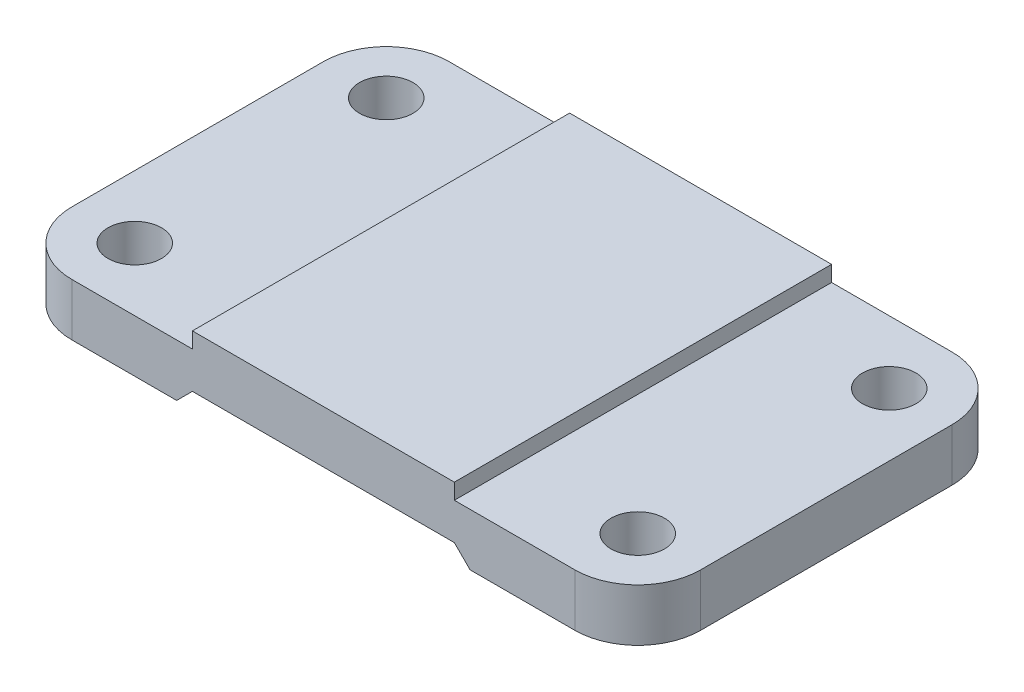
ISO-10303-21;
HEADER;
FILE_DESCRIPTION(('STEP AP214'),'2;1');
FILE_NAME('part.step','',(''),(''),'','','');
FILE_SCHEMA(('AUTOMOTIVE_DESIGN { 1 0 10303 214 1 1 1 1 }'));
ENDSEC;
DATA;
#1=APPLICATION_CONTEXT('core data for automotive mechanical design processes');
#2=APPLICATION_PROTOCOL_DEFINITION('international standard','automotive_design',2000,#1);
#3=PRODUCT_CONTEXT('',#1,'mechanical');
#4=PRODUCT('Part','Part','',(#3));
#5=PRODUCT_RELATED_PRODUCT_CATEGORY('part','',(#4));
#6=PRODUCT_DEFINITION_FORMATION('','',#4);
#7=PRODUCT_DEFINITION_CONTEXT('part definition',#1,'design');
#8=PRODUCT_DEFINITION('design','',#6,#7);
#9=PRODUCT_DEFINITION_SHAPE('','',#8);
#10=(LENGTH_UNIT() NAMED_UNIT(*) SI_UNIT(.MILLI.,.METRE.));
#11=(NAMED_UNIT(*) PLANE_ANGLE_UNIT() SI_UNIT($,.RADIAN.));
#12=(NAMED_UNIT(*) SI_UNIT($,.STERADIAN.) SOLID_ANGLE_UNIT());
#13=UNCERTAINTY_MEASURE_WITH_UNIT(LENGTH_MEASURE(1.E-05),#10,'distance_accuracy_value','');
#14=(GEOMETRIC_REPRESENTATION_CONTEXT(3) GLOBAL_UNCERTAINTY_ASSIGNED_CONTEXT((#13)) GLOBAL_UNIT_ASSIGNED_CONTEXT((#10,
#11,#12)) REPRESENTATION_CONTEXT('',''));
#15=CARTESIAN_POINT('',(0.,0.,0.));
#16=DIRECTION('',(0.,0.,1.));
#17=DIRECTION('',(1.,0.,0.));
#18=AXIS2_PLACEMENT_3D('',#15,#16,#17);
#19=CARTESIAN_POINT('',(0.,10.,0.));
#20=DIRECTION('',(0.,1.,0.));
#21=DIRECTION('',(0.,0.,1.));
#22=AXIS2_PLACEMENT_3D('',#19,#20,#21);
#23=PLANE('',#22);
#24=DIRECTION('',(0.,0.,-1.));
#25=VECTOR('',#24,1.);
#26=CARTESIAN_POINT('',(85.,10.,-72.));
#27=LINE('',#26,#25);
#28=CARTESIAN_POINT('',(85.,10.,0.));
#29=VERTEX_POINT('',#28);
#30=CARTESIAN_POINT('',(85.,10.,-72.));
#31=VERTEX_POINT('',#30);
#32=EDGE_CURVE('E168',#29,#31,#27,.T.);
#33=ORIENTED_EDGE('',*,*,#32,.F.);
#34=DIRECTION('',(1.,0.,0.));
#35=VECTOR('',#34,1.);
#36=CARTESIAN_POINT('',(0.,10.,0.));
#37=LINE('',#36,#35);
#38=CARTESIAN_POINT('',(108.,10.,0.));
#39=VERTEX_POINT('',#38);
#40=EDGE_CURVE('E220',#29,#39,#37,.T.);
#41=ORIENTED_EDGE('',*,*,#40,.T.);
#42=CARTESIAN_POINT('',(108.,10.,-12.));
#43=DIRECTION('',(0.,1.,0.));
#44=DIRECTION('',(0.,0.,1.));
#45=AXIS2_PLACEMENT_3D('',#42,#43,#44);
#46=CIRCLE('',#45,12.);
#47=CARTESIAN_POINT('',(120.,10.,-12.0000000000001));
#48=VERTEX_POINT('',#47);
#49=EDGE_CURVE('E223',#39,#48,#46,.T.);
#50=ORIENTED_EDGE('',*,*,#49,.T.);
#51=DIRECTION('',(0.,0.,1.));
#52=VECTOR('',#51,1.);
#53=CARTESIAN_POINT('',(120.,10.,0.));
#54=LINE('',#53,#52);
#55=CARTESIAN_POINT('',(120.,10.,-59.9999999999999));
#56=VERTEX_POINT('',#55);
#57=EDGE_CURVE('E225',#56,#48,#54,.T.);
#58=ORIENTED_EDGE('',*,*,#57,.F.);
#59=CARTESIAN_POINT('',(108.,10.,-60.));
#60=DIRECTION('',(0.,1.,0.));
#61=DIRECTION('',(0.,0.,1.));
#62=AXIS2_PLACEMENT_3D('',#59,#60,#61);
#63=CIRCLE('',#62,12.);
#64=CARTESIAN_POINT('',(108.,10.,-72.));
#65=VERTEX_POINT('',#64);
#66=EDGE_CURVE('E228',#65,#56,#63,.F.);
#67=ORIENTED_EDGE('',*,*,#66,.F.);
#68=DIRECTION('',(1.,0.,0.));
#69=VECTOR('',#68,1.);
#70=CARTESIAN_POINT('',(0.,10.,-72.));
#71=LINE('',#70,#69);
#72=EDGE_CURVE('E51',#31,#65,#71,.T.);
#73=ORIENTED_EDGE('',*,*,#72,.F.);
#74=EDGE_LOOP('',(#33,#41,#50,#58,#67,#73));
#75=FACE_BOUND('',#74,.T.);
#76=CARTESIAN_POINT('',(108.,10.,-60.));
#77=DIRECTION('',(0.,1.,0.));
#78=DIRECTION('',(0.,0.,1.));
#79=AXIS2_PLACEMENT_3D('',#76,#77,#78);
#80=CIRCLE('',#79,5.1);
#81=CARTESIAN_POINT('',(108.,10.,-54.9));
#82=VERTEX_POINT('',#81);
#83=EDGE_CURVE('E235',#82,#82,#80,.T.);
#84=ORIENTED_EDGE('',*,*,#83,.F.);
#85=EDGE_LOOP('',(#84));
#86=FACE_BOUND('',#85,.T.);
#87=CARTESIAN_POINT('',(108.,10.,-12.));
#88=DIRECTION('',(0.,1.,0.));
#89=DIRECTION('',(0.,0.,1.));
#90=AXIS2_PLACEMENT_3D('',#87,#88,#89);
#91=CIRCLE('',#90,5.1);
#92=CARTESIAN_POINT('',(108.,10.,-6.9));
#93=VERTEX_POINT('',#92);
#94=EDGE_CURVE('E232',#93,#93,#91,.T.);
#95=ORIENTED_EDGE('',*,*,#94,.F.);
#96=EDGE_LOOP('',(#95));
#97=FACE_BOUND('',#96,.T.);
#98=ADVANCED_FACE('F36',(#75,#86,#97),#23,.T.);
#99=CARTESIAN_POINT('',(0.,0.,0.));
#100=DIRECTION('',(0.,1.,0.));
#101=DIRECTION('',(0.,0.,1.));
#102=AXIS2_PLACEMENT_3D('',#99,#100,#101);
#103=PLANE('',#102);
#104=CARTESIAN_POINT('',(12.,0.,-60.));
#105=DIRECTION('',(0.,1.,0.));
#106=DIRECTION('',(0.,0.,1.));
#107=AXIS2_PLACEMENT_3D('',#104,#105,#106);
#108=CIRCLE('',#107,5.1);
#109=CARTESIAN_POINT('',(12.,0.,-54.9));
#110=VERTEX_POINT('',#109);
#111=EDGE_CURVE('E241',#110,#110,#108,.T.);
#112=ORIENTED_EDGE('',*,*,#111,.T.);
#113=EDGE_LOOP('',(#112));
#114=FACE_BOUND('',#113,.T.);
#115=CARTESIAN_POINT('',(12.,0.,-12.));
#116=DIRECTION('',(0.,1.,0.));
#117=DIRECTION('',(0.,0.,1.));
#118=AXIS2_PLACEMENT_3D('',#115,#116,#117);
#119=CIRCLE('',#118,5.1);
#120=CARTESIAN_POINT('',(12.,0.,-6.9));
#121=VERTEX_POINT('',#120);
#122=EDGE_CURVE('E198',#121,#121,#119,.T.);
#123=ORIENTED_EDGE('',*,*,#122,.T.);
#124=EDGE_LOOP('',(#123));
#125=FACE_BOUND('',#124,.T.);
#126=DIRECTION('',(1.,0.,0.));
#127=VECTOR('',#126,1.);
#128=CARTESIAN_POINT('',(0.,0.,-72.));
#129=LINE('',#128,#127);
#130=CARTESIAN_POINT('',(12.0000000000001,0.,-72.));
#131=VERTEX_POINT('',#130);
#132=CARTESIAN_POINT('',(32.,0.,-72.));
#133=VERTEX_POINT('',#132);
#134=EDGE_CURVE('E267',#131,#133,#129,.T.);
#135=ORIENTED_EDGE('',*,*,#134,.T.);
#136=DIRECTION('',(0.,0.,1.));
#137=VECTOR('',#136,1.);
#138=CARTESIAN_POINT('',(32.,0.,-72.));
#139=LINE('',#138,#137);
#140=CARTESIAN_POINT('',(32.,0.,0.));
#141=VERTEX_POINT('',#140);
#142=EDGE_CURVE('E195',#133,#141,#139,.T.);
#143=ORIENTED_EDGE('',*,*,#142,.T.);
#144=DIRECTION('',(1.,0.,0.));
#145=VECTOR('',#144,1.);
#146=CARTESIAN_POINT('',(0.,0.,0.));
#147=LINE('',#146,#145);
#148=CARTESIAN_POINT('',(12.0000000000001,0.,0.));
#149=VERTEX_POINT('',#148);
#150=EDGE_CURVE('E254',#149,#141,#147,.T.);
#151=ORIENTED_EDGE('',*,*,#150,.F.);
#152=CARTESIAN_POINT('',(12.,0.,-12.));
#153=DIRECTION('',(0.,1.,0.));
#154=DIRECTION('',(0.,0.,1.));
#155=AXIS2_PLACEMENT_3D('',#152,#153,#154);
#156=CIRCLE('',#155,12.);
#157=CARTESIAN_POINT('',(0.,0.,-12.0000000000001));
#158=VERTEX_POINT('',#157);
#159=EDGE_CURVE('E250',#149,#158,#156,.F.);
#160=ORIENTED_EDGE('',*,*,#159,.T.);
#161=DIRECTION('',(0.,0.,-1.));
#162=VECTOR('',#161,1.);
#163=CARTESIAN_POINT('',(0.,0.,0.));
#164=LINE('',#163,#162);
#165=CARTESIAN_POINT('',(0.,0.,-59.9999999999999));
#166=VERTEX_POINT('',#165);
#167=EDGE_CURVE('E247',#158,#166,#164,.T.);
#168=ORIENTED_EDGE('',*,*,#167,.T.);
#169=CARTESIAN_POINT('',(12.,0.,-60.));
#170=DIRECTION('',(0.,1.,0.));
#171=DIRECTION('',(0.,0.,1.));
#172=AXIS2_PLACEMENT_3D('',#169,#170,#171);
#173=CIRCLE('',#172,12.);
#174=EDGE_CURVE('E244',#166,#131,#173,.F.);
#175=ORIENTED_EDGE('',*,*,#174,.T.);
#176=EDGE_LOOP('',(#135,#143,#151,#160,#168,#175));
#177=FACE_BOUND('',#176,.T.);
#178=ADVANCED_FACE('F298',(#114,#125,#177),#103,.F.);
#179=CARTESIAN_POINT('',(12.,10.,-60.));
#180=DIRECTION('',(0.,-1.,0.));
#181=DIRECTION('',(0.,0.,-1.));
#182=AXIS2_PLACEMENT_3D('',#179,#180,#181);
#183=CYLINDRICAL_SURFACE('',#182,12.);
#184=ORIENTED_EDGE('',*,*,#174,.F.);
#185=DIRECTION('',(0.,-1.,0.));
#186=VECTOR('',#185,1.);
#187=CARTESIAN_POINT('',(0.,10.,-59.9999999999999));
#188=LINE('',#187,#186);
#189=CARTESIAN_POINT('',(0.,10.,-59.9999999999999));
#190=VERTEX_POINT('',#189);
#191=EDGE_CURVE('E11',#190,#166,#188,.T.);
#192=ORIENTED_EDGE('',*,*,#191,.F.);
#193=CARTESIAN_POINT('',(12.,10.,-60.));
#194=DIRECTION('',(0.,1.,0.));
#195=DIRECTION('',(0.,0.,1.));
#196=AXIS2_PLACEMENT_3D('',#193,#194,#195);
#197=CIRCLE('',#196,12.);
#198=CARTESIAN_POINT('',(12.0000000000001,10.,-72.));
#199=VERTEX_POINT('',#198);
#200=EDGE_CURVE('E211',#190,#199,#197,.F.);
#201=ORIENTED_EDGE('',*,*,#200,.T.);
#202=DIRECTION('',(0.,-1.,0.));
#203=VECTOR('',#202,1.);
#204=CARTESIAN_POINT('',(12.0000000000001,10.,-72.));
#205=LINE('',#204,#203);
#206=EDGE_CURVE('E238',#199,#131,#205,.T.);
#207=ORIENTED_EDGE('',*,*,#206,.T.);
#208=EDGE_LOOP('',(#184,#192,#201,#207));
#209=FACE_BOUND('',#208,.T.);
#210=ADVANCED_FACE('F308',(#209),#183,.T.);
#211=CARTESIAN_POINT('',(0.,10.,0.));
#212=DIRECTION('',(-1.,0.,0.));
#213=DIRECTION('',(0.,0.,1.));
#214=AXIS2_PLACEMENT_3D('',#211,#212,#213);
#215=PLANE('',#214);
#216=ORIENTED_EDGE('',*,*,#167,.F.);
#217=DIRECTION('',(0.,-1.,0.));
#218=VECTOR('',#217,1.);
#219=CARTESIAN_POINT('',(0.,10.,-12.0000000000001));
#220=LINE('',#219,#218);
#221=CARTESIAN_POINT('',(0.,10.,-12.0000000000001));
#222=VERTEX_POINT('',#221);
#223=EDGE_CURVE('E44',#222,#158,#220,.T.);
#224=ORIENTED_EDGE('',*,*,#223,.F.);
#225=DIRECTION('',(0.,0.,-1.));
#226=VECTOR('',#225,1.);
#227=CARTESIAN_POINT('',(0.,10.,0.));
#228=LINE('',#227,#226);
#229=EDGE_CURVE('E214',#222,#190,#228,.T.);
#230=ORIENTED_EDGE('',*,*,#229,.T.);
#231=ORIENTED_EDGE('',*,*,#191,.T.);
#232=EDGE_LOOP('',(#216,#224,#230,#231));
#233=FACE_BOUND('',#232,.T.);
#234=ADVANCED_FACE('F294',(#233),#215,.T.);
#235=CARTESIAN_POINT('',(12.,10.,-12.));
#236=DIRECTION('',(0.,-1.,0.));
#237=DIRECTION('',(0.,0.,-1.));
#238=AXIS2_PLACEMENT_3D('',#235,#236,#237);
#239=CYLINDRICAL_SURFACE('',#238,12.);
#240=ORIENTED_EDGE('',*,*,#159,.F.);
#241=DIRECTION('',(0.,-1.,0.));
#242=VECTOR('',#241,1.);
#243=CARTESIAN_POINT('',(12.0000000000001,10.,0.));
#244=LINE('',#243,#242);
#245=CARTESIAN_POINT('',(12.0000000000001,10.,0.));
#246=VERTEX_POINT('',#245);
#247=EDGE_CURVE('E286',#246,#149,#244,.T.);
#248=ORIENTED_EDGE('',*,*,#247,.F.);
#249=CARTESIAN_POINT('',(12.,10.,-12.));
#250=DIRECTION('',(0.,1.,0.));
#251=DIRECTION('',(0.,0.,1.));
#252=AXIS2_PLACEMENT_3D('',#249,#250,#251);
#253=CIRCLE('',#252,12.);
#254=EDGE_CURVE('E217',#246,#222,#253,.F.);
#255=ORIENTED_EDGE('',*,*,#254,.T.);
#256=ORIENTED_EDGE('',*,*,#223,.T.);
#257=EDGE_LOOP('',(#240,#248,#255,#256));
#258=FACE_BOUND('',#257,.T.);
#259=ADVANCED_FACE('F290',(#258),#239,.T.);
#260=CARTESIAN_POINT('',(0.,10.,0.));
#261=DIRECTION('',(0.,0.,-1.));
#262=DIRECTION('',(-1.,0.,0.));
#263=AXIS2_PLACEMENT_3D('',#260,#261,#262);
#264=PLANE('',#263);
#265=ORIENTED_EDGE('',*,*,#150,.T.);
#266=DIRECTION('',(-0.707106781186546,-0.707106781186549,0.));
#267=VECTOR('',#266,1.);
#268=CARTESIAN_POINT('',(32.,0.,0.));
#269=LINE('',#268,#267);
#270=CARTESIAN_POINT('',(35.,3.,0.));
#271=VERTEX_POINT('',#270);
#272=EDGE_CURVE('E186',#271,#141,#269,.T.);
#273=ORIENTED_EDGE('',*,*,#272,.F.);
#274=DIRECTION('',(-1.,0.,0.));
#275=VECTOR('',#274,1.);
#276=CARTESIAN_POINT('',(35.,3.,0.));
#277=LINE('',#276,#275);
#278=CARTESIAN_POINT('',(85.,3.,0.));
#279=VERTEX_POINT('',#278);
#280=EDGE_CURVE('E176',#279,#271,#277,.T.);
#281=ORIENTED_EDGE('',*,*,#280,.F.);
#282=DIRECTION('',(-0.707106781186545,0.70710678118655,0.));
#283=VECTOR('',#282,1.);
#284=CARTESIAN_POINT('',(85.,3.,0.));
#285=LINE('',#284,#283);
#286=CARTESIAN_POINT('',(88.,0.,0.));
#287=VERTEX_POINT('',#286);
#288=EDGE_CURVE('E173',#287,#279,#285,.T.);
#289=ORIENTED_EDGE('',*,*,#288,.F.);
#290=CARTESIAN_POINT('',(108.,0.,0.));
#291=VERTEX_POINT('',#290);
#292=EDGE_CURVE('E253',#287,#291,#147,.T.);
#293=ORIENTED_EDGE('',*,*,#292,.T.);
#294=DIRECTION('',(0.,-1.,0.));
#295=VECTOR('',#294,1.);
#296=CARTESIAN_POINT('',(108.,10.,0.));
#297=LINE('',#296,#295);
#298=EDGE_CURVE('E283',#39,#291,#297,.T.);
#299=ORIENTED_EDGE('',*,*,#298,.F.);
#300=ORIENTED_EDGE('',*,*,#40,.F.);
#301=DIRECTION('',(0.,-1.,0.));
#302=VECTOR('',#301,1.);
#303=CARTESIAN_POINT('',(85.,13.,0.));
#304=LINE('',#303,#302);
#305=CARTESIAN_POINT('',(85.,13.,0.));
#306=VERTEX_POINT('',#305);
#307=EDGE_CURVE('E178',#306,#29,#304,.T.);
#308=ORIENTED_EDGE('',*,*,#307,.F.);
#309=DIRECTION('',(1.,0.,0.));
#310=VECTOR('',#309,1.);
#311=CARTESIAN_POINT('',(35.,13.,0.));
#312=LINE('',#311,#310);
#313=CARTESIAN_POINT('',(35.,13.,0.));
#314=VERTEX_POINT('',#313);
#315=EDGE_CURVE('E158',#314,#306,#312,.T.);
#316=ORIENTED_EDGE('',*,*,#315,.F.);
#317=DIRECTION('',(0.,-1.,0.));
#318=VECTOR('',#317,1.);
#319=CARTESIAN_POINT('',(35.,13.,0.));
#320=LINE('',#319,#318);
#321=CARTESIAN_POINT('',(35.,10.,0.));
#322=VERTEX_POINT('',#321);
#323=EDGE_CURVE('E155',#314,#322,#320,.T.);
#324=ORIENTED_EDGE('',*,*,#323,.T.);
#325=EDGE_CURVE('E221',#246,#322,#37,.T.);
#326=ORIENTED_EDGE('',*,*,#325,.F.);
#327=ORIENTED_EDGE('',*,*,#247,.T.);
#328=EDGE_LOOP('',(#265,#273,#281,#289,#293,#299,#300,#308,#316,#324,#326,#327));
#329=FACE_BOUND('',#328,.T.);
#330=ADVANCED_FACE('F301',(#329),#264,.F.);
#331=CARTESIAN_POINT('',(108.,10.,-12.));
#332=DIRECTION('',(0.,-1.,0.));
#333=DIRECTION('',(0.,0.,-1.));
#334=AXIS2_PLACEMENT_3D('',#331,#332,#333);
#335=CYLINDRICAL_SURFACE('',#334,12.);
#336=CARTESIAN_POINT('',(108.,0.,-12.));
#337=DIRECTION('',(0.,1.,0.));
#338=DIRECTION('',(0.,0.,1.));
#339=AXIS2_PLACEMENT_3D('',#336,#337,#338);
#340=CIRCLE('',#339,12.);
#341=CARTESIAN_POINT('',(120.,0.,-12.0000000000001));
#342=VERTEX_POINT('',#341);
#343=EDGE_CURVE('E257',#291,#342,#340,.T.);
#344=ORIENTED_EDGE('',*,*,#343,.T.);
#345=DIRECTION('',(0.,-1.,0.));
#346=VECTOR('',#345,1.);
#347=CARTESIAN_POINT('',(120.,10.,-12.0000000000001));
#348=LINE('',#347,#346);
#349=EDGE_CURVE('E281',#48,#342,#348,.T.);
#350=ORIENTED_EDGE('',*,*,#349,.F.);
#351=ORIENTED_EDGE('',*,*,#49,.F.);
#352=ORIENTED_EDGE('',*,*,#298,.T.);
#353=EDGE_LOOP('',(#344,#350,#351,#352));
#354=FACE_BOUND('',#353,.T.);
#355=ADVANCED_FACE('F330',(#354),#335,.T.);
#356=CARTESIAN_POINT('',(120.,10.,0.));
#357=DIRECTION('',(1.,0.,0.));
#358=DIRECTION('',(0.,0.,-1.));
#359=AXIS2_PLACEMENT_3D('',#356,#357,#358);
#360=PLANE('',#359);
#361=DIRECTION('',(0.,0.,1.));
#362=VECTOR('',#361,1.);
#363=CARTESIAN_POINT('',(120.,0.,0.));
#364=LINE('',#363,#362);
#365=CARTESIAN_POINT('',(120.,0.,-59.9999999999999));
#366=VERTEX_POINT('',#365);
#367=EDGE_CURVE('E260',#366,#342,#364,.T.);
#368=ORIENTED_EDGE('',*,*,#367,.F.);
#369=DIRECTION('',(0.,-1.,0.));
#370=VECTOR('',#369,1.);
#371=CARTESIAN_POINT('',(120.,10.,-59.9999999999999));
#372=LINE('',#371,#370);
#373=EDGE_CURVE('E279',#56,#366,#372,.T.);
#374=ORIENTED_EDGE('',*,*,#373,.F.);
#375=ORIENTED_EDGE('',*,*,#57,.T.);
#376=ORIENTED_EDGE('',*,*,#349,.T.);
#377=EDGE_LOOP('',(#368,#374,#375,#376));
#378=FACE_BOUND('',#377,.T.);
#379=ADVANCED_FACE('F349',(#378),#360,.T.);
#380=CARTESIAN_POINT('',(108.,10.,-60.));
#381=DIRECTION('',(0.,-1.,0.));
#382=DIRECTION('',(0.,0.,-1.));
#383=AXIS2_PLACEMENT_3D('',#380,#381,#382);
#384=CYLINDRICAL_SURFACE('',#383,12.);
#385=CARTESIAN_POINT('',(108.,0.,-60.));
#386=DIRECTION('',(0.,1.,0.));
#387=DIRECTION('',(0.,0.,1.));
#388=AXIS2_PLACEMENT_3D('',#385,#386,#387);
#389=CIRCLE('',#388,12.);
#390=CARTESIAN_POINT('',(108.,0.,-72.));
#391=VERTEX_POINT('',#390);
#392=EDGE_CURVE('E263',#391,#366,#389,.F.);
#393=ORIENTED_EDGE('',*,*,#392,.F.);
#394=DIRECTION('',(0.,-1.,0.));
#395=VECTOR('',#394,1.);
#396=CARTESIAN_POINT('',(108.,10.,-72.));
#397=LINE('',#396,#395);
#398=EDGE_CURVE('E276',#65,#391,#397,.T.);
#399=ORIENTED_EDGE('',*,*,#398,.F.);
#400=ORIENTED_EDGE('',*,*,#66,.T.);
#401=ORIENTED_EDGE('',*,*,#373,.T.);
#402=EDGE_LOOP('',(#393,#399,#400,#401));
#403=FACE_BOUND('',#402,.T.);
#404=ADVANCED_FACE('F345',(#403),#384,.T.);
#405=CARTESIAN_POINT('',(108.,10.,-12.));
#406=DIRECTION('',(0.,-1.,0.));
#407=DIRECTION('',(0.,0.,-1.));
#408=AXIS2_PLACEMENT_3D('',#405,#406,#407);
#409=CYLINDRICAL_SURFACE('',#408,5.1);
#410=ORIENTED_EDGE('',*,*,#94,.T.);
#411=EDGE_LOOP('',(#410));
#412=FACE_BOUND('',#411,.T.);
#413=CARTESIAN_POINT('',(108.,0.,-12.));
#414=DIRECTION('',(0.,1.,0.));
#415=DIRECTION('',(0.,0.,1.));
#416=AXIS2_PLACEMENT_3D('',#413,#414,#415);
#417=CIRCLE('',#416,5.1);
#418=CARTESIAN_POINT('',(108.,0.,-6.9));
#419=VERTEX_POINT('',#418);
#420=EDGE_CURVE('E270',#419,#419,#417,.T.);
#421=ORIENTED_EDGE('',*,*,#420,.F.);
#422=EDGE_LOOP('',(#421));
#423=FACE_BOUND('',#422,.T.);
#424=ADVANCED_FACE('F381',(#412,#423),#409,.F.);
#425=CARTESIAN_POINT('',(0.,10.,-72.));
#426=DIRECTION('',(0.,0.,-1.));
#427=DIRECTION('',(-1.,0.,0.));
#428=AXIS2_PLACEMENT_3D('',#425,#426,#427);
#429=PLANE('',#428);
#430=DIRECTION('',(-0.707106781186546,-0.707106781186549,0.));
#431=VECTOR('',#430,1.);
#432=CARTESIAN_POINT('',(32.,0.,-72.));
#433=LINE('',#432,#431);
#434=CARTESIAN_POINT('',(35.,3.,-72.));
#435=VERTEX_POINT('',#434);
#436=EDGE_CURVE('E189',#435,#133,#433,.T.);
#437=ORIENTED_EDGE('',*,*,#436,.T.);
#438=ORIENTED_EDGE('',*,*,#134,.F.);
#439=ORIENTED_EDGE('',*,*,#206,.F.);
#440=CARTESIAN_POINT('',(35.,10.,-72.));
#441=VERTEX_POINT('',#440);
#442=EDGE_CURVE('E172',#199,#441,#71,.T.);
#443=ORIENTED_EDGE('',*,*,#442,.T.);
#444=DIRECTION('',(0.,-1.,0.));
#445=VECTOR('',#444,1.);
#446=CARTESIAN_POINT('',(35.,13.,-72.));
#447=LINE('',#446,#445);
#448=CARTESIAN_POINT('',(35.,13.,-72.));
#449=VERTEX_POINT('',#448);
#450=EDGE_CURVE('E153',#449,#441,#447,.T.);
#451=ORIENTED_EDGE('',*,*,#450,.F.);
#452=DIRECTION('',(-1.,0.,0.));
#453=VECTOR('',#452,1.);
#454=CARTESIAN_POINT('',(35.,13.,-72.));
#455=LINE('',#454,#453);
#456=CARTESIAN_POINT('',(85.,13.,-72.));
#457=VERTEX_POINT('',#456);
#458=EDGE_CURVE('E159',#457,#449,#455,.T.);
#459=ORIENTED_EDGE('',*,*,#458,.F.);
#460=DIRECTION('',(0.,-1.,0.));
#461=VECTOR('',#460,1.);
#462=CARTESIAN_POINT('',(85.,13.,-72.));
#463=LINE('',#462,#461);
#464=EDGE_CURVE('E336',#457,#31,#463,.T.);
#465=ORIENTED_EDGE('',*,*,#464,.T.);
#466=ORIENTED_EDGE('',*,*,#72,.T.);
#467=ORIENTED_EDGE('',*,*,#398,.T.);
#468=CARTESIAN_POINT('',(88.,0.,-72.));
#469=VERTEX_POINT('',#468);
#470=EDGE_CURVE('E266',#469,#391,#129,.T.);
#471=ORIENTED_EDGE('',*,*,#470,.F.);
#472=DIRECTION('',(-0.707106781186545,0.70710678118655,0.));
#473=VECTOR('',#472,1.);
#474=CARTESIAN_POINT('',(85.,3.,-72.));
#475=LINE('',#474,#473);
#476=CARTESIAN_POINT('',(85.,3.,-72.));
#477=VERTEX_POINT('',#476);
#478=EDGE_CURVE('E182',#469,#477,#475,.T.);
#479=ORIENTED_EDGE('',*,*,#478,.T.);
#480=DIRECTION('',(-1.,0.,0.));
#481=VECTOR('',#480,1.);
#482=CARTESIAN_POINT('',(35.,3.,-72.));
#483=LINE('',#482,#481);
#484=EDGE_CURVE('E185',#477,#435,#483,.T.);
#485=ORIENTED_EDGE('',*,*,#484,.T.);
#486=EDGE_LOOP('',(#437,#438,#439,#443,#451,#459,#465,#466,#467,#471,#479,#485));
#487=FACE_BOUND('',#486,.T.);
#488=ADVANCED_FACE('F171',(#487),#429,.T.);
#489=CARTESIAN_POINT('',(12.,10.,-60.));
#490=DIRECTION('',(0.,-1.,0.));
#491=DIRECTION('',(0.,0.,-1.));
#492=AXIS2_PLACEMENT_3D('',#489,#490,#491);
#493=CYLINDRICAL_SURFACE('',#492,5.1);
#494=CARTESIAN_POINT('',(12.,10.,-60.));
#495=DIRECTION('',(0.,1.,0.));
#496=DIRECTION('',(0.,0.,1.));
#497=AXIS2_PLACEMENT_3D('',#494,#495,#496);
#498=CIRCLE('',#497,5.1);
#499=CARTESIAN_POINT('',(12.,10.,-54.9));
#500=VERTEX_POINT('',#499);
#501=EDGE_CURVE('E207',#500,#500,#498,.T.);
#502=ORIENTED_EDGE('',*,*,#501,.T.);
#503=EDGE_LOOP('',(#502));
#504=FACE_BOUND('',#503,.T.);
#505=ORIENTED_EDGE('',*,*,#111,.F.);
#506=EDGE_LOOP('',(#505));
#507=FACE_BOUND('',#506,.T.);
#508=ADVANCED_FACE('F377',(#504,#507),#493,.F.);
#509=CARTESIAN_POINT('',(12.,10.,-12.));
#510=DIRECTION('',(0.,-1.,0.));
#511=DIRECTION('',(0.,0.,-1.));
#512=AXIS2_PLACEMENT_3D('',#509,#510,#511);
#513=CYLINDRICAL_SURFACE('',#512,5.1);
#514=CARTESIAN_POINT('',(12.,10.,-12.));
#515=DIRECTION('',(0.,1.,0.));
#516=DIRECTION('',(0.,0.,1.));
#517=AXIS2_PLACEMENT_3D('',#514,#515,#516);
#518=CIRCLE('',#517,5.1);
#519=CARTESIAN_POINT('',(12.,10.,-6.9));
#520=VERTEX_POINT('',#519);
#521=EDGE_CURVE('E204',#520,#520,#518,.T.);
#522=ORIENTED_EDGE('',*,*,#521,.T.);
#523=EDGE_LOOP('',(#522));
#524=FACE_BOUND('',#523,.T.);
#525=ORIENTED_EDGE('',*,*,#122,.F.);
#526=EDGE_LOOP('',(#525));
#527=FACE_BOUND('',#526,.T.);
#528=ADVANCED_FACE('F38',(#524,#527),#513,.F.);
#529=CARTESIAN_POINT('',(108.,10.,-60.));
#530=DIRECTION('',(0.,-1.,0.));
#531=DIRECTION('',(0.,0.,-1.));
#532=AXIS2_PLACEMENT_3D('',#529,#530,#531);
#533=CYLINDRICAL_SURFACE('',#532,5.1);
#534=ORIENTED_EDGE('',*,*,#83,.T.);
#535=EDGE_LOOP('',(#534));
#536=FACE_BOUND('',#535,.T.);
#537=CARTESIAN_POINT('',(108.,0.,-60.));
#538=DIRECTION('',(0.,1.,0.));
#539=DIRECTION('',(0.,0.,1.));
#540=AXIS2_PLACEMENT_3D('',#537,#538,#539);
#541=CIRCLE('',#540,5.1);
#542=CARTESIAN_POINT('',(108.,0.,-54.9));
#543=VERTEX_POINT('',#542);
#544=EDGE_CURVE('E208',#543,#543,#541,.T.);
#545=ORIENTED_EDGE('',*,*,#544,.F.);
#546=EDGE_LOOP('',(#545));
#547=FACE_BOUND('',#546,.T.);
#548=ADVANCED_FACE('F367',(#536,#547),#533,.F.);
#549=DIRECTION('',(0.,0.,1.));
#550=VECTOR('',#549,1.);
#551=CARTESIAN_POINT('',(35.,10.,-72.));
#552=LINE('',#551,#550);
#553=EDGE_CURVE('E59',#441,#322,#552,.T.);
#554=ORIENTED_EDGE('',*,*,#553,.F.);
#555=ORIENTED_EDGE('',*,*,#442,.F.);
#556=ORIENTED_EDGE('',*,*,#200,.F.);
#557=ORIENTED_EDGE('',*,*,#229,.F.);
#558=ORIENTED_EDGE('',*,*,#254,.F.);
#559=ORIENTED_EDGE('',*,*,#325,.T.);
#560=EDGE_LOOP('',(#554,#555,#556,#557,#558,#559));
#561=FACE_BOUND('',#560,.T.);
#562=ORIENTED_EDGE('',*,*,#521,.F.);
#563=EDGE_LOOP('',(#562));
#564=FACE_BOUND('',#563,.T.);
#565=ORIENTED_EDGE('',*,*,#501,.F.);
#566=EDGE_LOOP('',(#565));
#567=FACE_BOUND('',#566,.T.);
#568=ADVANCED_FACE('F304',(#561,#564,#567),#23,.T.);
#569=ORIENTED_EDGE('',*,*,#292,.F.);
#570=DIRECTION('',(0.,0.,1.));
#571=VECTOR('',#570,1.);
#572=CARTESIAN_POINT('',(88.,0.,-72.));
#573=LINE('',#572,#571);
#574=EDGE_CURVE('E190',#469,#287,#573,.T.);
#575=ORIENTED_EDGE('',*,*,#574,.F.);
#576=ORIENTED_EDGE('',*,*,#470,.T.);
#577=ORIENTED_EDGE('',*,*,#392,.T.);
#578=ORIENTED_EDGE('',*,*,#367,.T.);
#579=ORIENTED_EDGE('',*,*,#343,.F.);
#580=EDGE_LOOP('',(#569,#575,#576,#577,#578,#579));
#581=FACE_BOUND('',#580,.T.);
#582=ORIENTED_EDGE('',*,*,#420,.T.);
#583=EDGE_LOOP('',(#582));
#584=FACE_BOUND('',#583,.T.);
#585=ORIENTED_EDGE('',*,*,#544,.T.);
#586=EDGE_LOOP('',(#585));
#587=FACE_BOUND('',#586,.T.);
#588=ADVANCED_FACE('F323',(#581,#584,#587),#103,.F.);
#589=CARTESIAN_POINT('',(32.,0.,-72.));
#590=DIRECTION('',(-0.707106781186549,0.707106781186546,0.));
#591=DIRECTION('',(-0.707106781186546,-0.707106781186549,0.));
#592=AXIS2_PLACEMENT_3D('',#589,#590,#591);
#593=PLANE('',#592);
#594=ORIENTED_EDGE('',*,*,#272,.T.);
#595=ORIENTED_EDGE('',*,*,#142,.F.);
#596=ORIENTED_EDGE('',*,*,#436,.F.);
#597=DIRECTION('',(0.,0.,1.));
#598=VECTOR('',#597,1.);
#599=CARTESIAN_POINT('',(35.,3.,-72.));
#600=LINE('',#599,#598);
#601=EDGE_CURVE('E199',#435,#271,#600,.T.);
#602=ORIENTED_EDGE('',*,*,#601,.T.);
#603=EDGE_LOOP('',(#594,#595,#596,#602));
#604=FACE_BOUND('',#603,.T.);
#605=ADVANCED_FACE('F313',(#604),#593,.F.);
#606=CARTESIAN_POINT('',(35.,3.,-72.));
#607=DIRECTION('',(0.,1.,0.));
#608=DIRECTION('',(-1.,0.,0.));
#609=AXIS2_PLACEMENT_3D('',#606,#607,#608);
#610=PLANE('',#609);
#611=ORIENTED_EDGE('',*,*,#280,.T.);
#612=ORIENTED_EDGE('',*,*,#601,.F.);
#613=ORIENTED_EDGE('',*,*,#484,.F.);
#614=DIRECTION('',(0.,0.,1.));
#615=VECTOR('',#614,1.);
#616=CARTESIAN_POINT('',(85.,3.,-72.));
#617=LINE('',#616,#615);
#618=EDGE_CURVE('E201',#477,#279,#617,.T.);
#619=ORIENTED_EDGE('',*,*,#618,.T.);
#620=EDGE_LOOP('',(#611,#612,#613,#619));
#621=FACE_BOUND('',#620,.T.);
#622=ADVANCED_FACE('F315',(#621),#610,.F.);
#623=CARTESIAN_POINT('',(85.,3.,-72.));
#624=DIRECTION('',(0.70710678118655,0.707106781186545,0.));
#625=DIRECTION('',(-0.707106781186545,0.70710678118655,0.));
#626=AXIS2_PLACEMENT_3D('',#623,#624,#625);
#627=PLANE('',#626);
#628=ORIENTED_EDGE('',*,*,#288,.T.);
#629=ORIENTED_EDGE('',*,*,#618,.F.);
#630=ORIENTED_EDGE('',*,*,#478,.F.);
#631=ORIENTED_EDGE('',*,*,#574,.T.);
#632=EDGE_LOOP('',(#628,#629,#630,#631));
#633=FACE_BOUND('',#632,.T.);
#634=ADVANCED_FACE('F350',(#633),#627,.F.);
#635=CARTESIAN_POINT('',(35.,13.,-72.));
#636=DIRECTION('',(1.,0.,0.));
#637=DIRECTION('',(0.,0.,-1.));
#638=AXIS2_PLACEMENT_3D('',#635,#636,#637);
#639=PLANE('',#638);
#640=ORIENTED_EDGE('',*,*,#553,.T.);
#641=ORIENTED_EDGE('',*,*,#323,.F.);
#642=DIRECTION('',(0.,0.,1.));
#643=VECTOR('',#642,1.);
#644=CARTESIAN_POINT('',(35.,13.,-72.));
#645=LINE('',#644,#643);
#646=EDGE_CURVE('E149',#449,#314,#645,.T.);
#647=ORIENTED_EDGE('',*,*,#646,.F.);
#648=ORIENTED_EDGE('',*,*,#450,.T.);
#649=EDGE_LOOP('',(#640,#641,#647,#648));
#650=FACE_BOUND('',#649,.T.);
#651=ADVANCED_FACE('F151',(#650),#639,.F.);
#652=CARTESIAN_POINT('',(85.,13.,-72.));
#653=DIRECTION('',(-1.,0.,0.));
#654=DIRECTION('',(0.,0.,1.));
#655=AXIS2_PLACEMENT_3D('',#652,#653,#654);
#656=PLANE('',#655);
#657=ORIENTED_EDGE('',*,*,#32,.T.);
#658=ORIENTED_EDGE('',*,*,#464,.F.);
#659=DIRECTION('',(0.,0.,-1.));
#660=VECTOR('',#659,1.);
#661=CARTESIAN_POINT('',(85.,13.,-72.));
#662=LINE('',#661,#660);
#663=EDGE_CURVE('E164',#306,#457,#662,.T.);
#664=ORIENTED_EDGE('',*,*,#663,.F.);
#665=ORIENTED_EDGE('',*,*,#307,.T.);
#666=EDGE_LOOP('',(#657,#658,#664,#665));
#667=FACE_BOUND('',#666,.T.);
#668=ADVANCED_FACE('F335',(#667),#656,.F.);
#669=CARTESIAN_POINT('',(0.,13.,0.));
#670=DIRECTION('',(0.,-1.,0.));
#671=DIRECTION('',(0.,0.,-1.));
#672=AXIS2_PLACEMENT_3D('',#669,#670,#671);
#673=PLANE('',#672);
#674=ORIENTED_EDGE('',*,*,#458,.T.);
#675=ORIENTED_EDGE('',*,*,#646,.T.);
#676=ORIENTED_EDGE('',*,*,#315,.T.);
#677=ORIENTED_EDGE('',*,*,#663,.T.);
#678=EDGE_LOOP('',(#674,#675,#676,#677));
#679=FACE_BOUND('',#678,.T.);
#680=ADVANCED_FACE('F162',(#679),#673,.F.);
#681=CLOSED_SHELL('',(#98,#178,#210,#234,#259,#330,#355,#379,#404,#424,#488,#508,#528,#548,#568,
#588,#605,#622,#634,#651,#668,#680));
#682=MANIFOLD_SOLID_BREP('B2',#681);
#683=ADVANCED_BREP_SHAPE_REPRESENTATION('',(#18,#682),#14);
#684=SHAPE_DEFINITION_REPRESENTATION(#9,#683);
ENDSEC;
END-ISO-10303-21;
